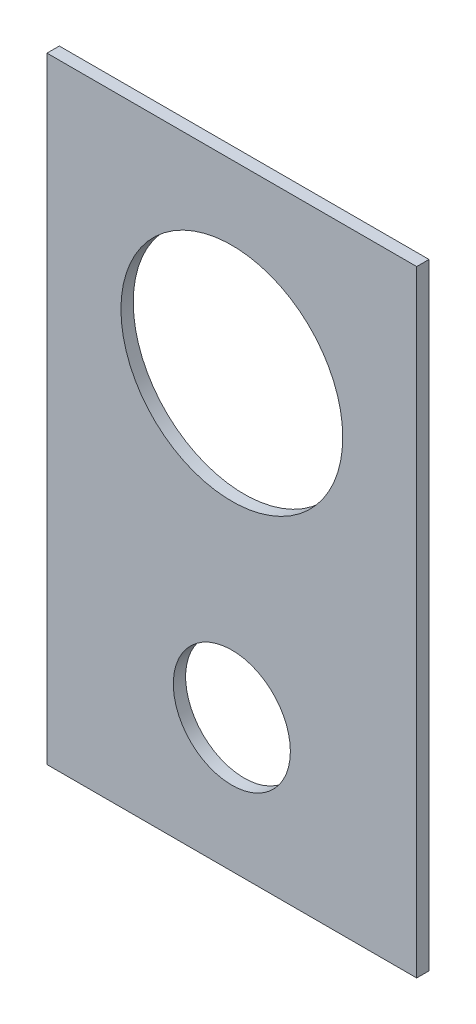
ISO-10303-21;
HEADER;
FILE_DESCRIPTION(('STEP AP214'),'2;1');
FILE_NAME('part.step','',(''),(''),'','','');
FILE_SCHEMA(('AUTOMOTIVE_DESIGN { 1 0 10303 214 1 1 1 1 }'));
ENDSEC;
DATA;
#1=APPLICATION_CONTEXT('core data for automotive mechanical design processes');
#2=APPLICATION_PROTOCOL_DEFINITION('international standard','automotive_design',2000,#1);
#3=PRODUCT_CONTEXT('',#1,'mechanical');
#4=PRODUCT('Part','Part','',(#3));
#5=PRODUCT_RELATED_PRODUCT_CATEGORY('part','',(#4));
#6=PRODUCT_DEFINITION_FORMATION('','',#4);
#7=PRODUCT_DEFINITION_CONTEXT('part definition',#1,'design');
#8=PRODUCT_DEFINITION('design','',#6,#7);
#9=PRODUCT_DEFINITION_SHAPE('','',#8);
#10=(LENGTH_UNIT() NAMED_UNIT(*) SI_UNIT(.MILLI.,.METRE.));
#11=(NAMED_UNIT(*) PLANE_ANGLE_UNIT() SI_UNIT($,.RADIAN.));
#12=(NAMED_UNIT(*) SI_UNIT($,.STERADIAN.) SOLID_ANGLE_UNIT());
#13=UNCERTAINTY_MEASURE_WITH_UNIT(LENGTH_MEASURE(1.E-05),#10,'distance_accuracy_value','');
#14=(GEOMETRIC_REPRESENTATION_CONTEXT(3) GLOBAL_UNCERTAINTY_ASSIGNED_CONTEXT((#13)) GLOBAL_UNIT_ASSIGNED_CONTEXT((#10,
#11,#12)) REPRESENTATION_CONTEXT('',''));
#15=CARTESIAN_POINT('',(0.,0.,0.));
#16=DIRECTION('',(0.,0.,1.));
#17=DIRECTION('',(1.,0.,0.));
#18=AXIS2_PLACEMENT_3D('',#15,#16,#17);
#19=CARTESIAN_POINT('',(0.,1100.09695005203,-9.99999999999975));
#20=DIRECTION('',(-1.,0.,0.));
#21=DIRECTION('',(0.,1.,0.));
#22=AXIS2_PLACEMENT_3D('',#19,#20,#21);
#23=PLANE('',#22);
#24=DIRECTION('',(0.,1.,0.));
#25=VECTOR('',#24,1.);
#26=CARTESIAN_POINT('',(0.,1100.09695005203,2.53676555219679E-13));
#27=LINE('',#26,#25);
#28=CARTESIAN_POINT('',(-1.20207153456121E-13,600.096950052034,0.));
#29=VERTEX_POINT('',#28);
#30=CARTESIAN_POINT('',(0.,1100.09695005203,2.53676555219679E-13));
#31=VERTEX_POINT('',#30);
#32=EDGE_CURVE('E94',#29,#31,#27,.T.);
#33=ORIENTED_EDGE('',*,*,#32,.T.);
#34=DIRECTION('',(0.,0.,1.));
#35=VECTOR('',#34,1.);
#36=CARTESIAN_POINT('',(0.,1100.09695005203,-9.99999999999975));
#37=LINE('',#36,#35);
#38=CARTESIAN_POINT('',(0.,1100.09695005203,-9.99999999999975));
#39=VERTEX_POINT('',#38);
#40=EDGE_CURVE('E33',#39,#31,#37,.T.);
#41=ORIENTED_EDGE('',*,*,#40,.F.);
#42=DIRECTION('',(0.,1.,0.));
#43=VECTOR('',#42,1.);
#44=CARTESIAN_POINT('',(0.,1100.09695005203,-9.99999999999975));
#45=LINE('',#44,#43);
#46=CARTESIAN_POINT('',(-1.20207153456121E-13,600.096950052034,-9.99999999999998));
#47=VERTEX_POINT('',#46);
#48=EDGE_CURVE('E83',#47,#39,#45,.T.);
#49=ORIENTED_EDGE('',*,*,#48,.F.);
#50=DIRECTION('',(0.,0.,1.));
#51=VECTOR('',#50,1.);
#52=CARTESIAN_POINT('',(-1.20207153456121E-13,600.096950052034,-9.99999999999998));
#53=LINE('',#52,#51);
#54=EDGE_CURVE('E11',#47,#29,#53,.T.);
#55=ORIENTED_EDGE('',*,*,#54,.T.);
#56=EDGE_LOOP('',(#33,#41,#49,#55));
#57=FACE_BOUND('',#56,.T.);
#58=ADVANCED_FACE('F30',(#57),#23,.T.);
#59=CARTESIAN_POINT('',(-1.20207153456121E-13,600.096950052034,-9.99999999999998));
#60=DIRECTION('',(0.,-1.,0.));
#61=DIRECTION('',(0.,0.,1.));
#62=AXIS2_PLACEMENT_3D('',#59,#60,#61);
#63=PLANE('',#62);
#64=DIRECTION('',(-1.,0.,0.));
#65=VECTOR('',#64,1.);
#66=CARTESIAN_POINT('',(-1.20207153456121E-13,600.096950052034,0.));
#67=LINE('',#66,#65);
#68=CARTESIAN_POINT('',(300.,600.096950052034,0.));
#69=VERTEX_POINT('',#68);
#70=EDGE_CURVE('E71',#69,#29,#67,.T.);
#71=ORIENTED_EDGE('',*,*,#70,.T.);
#72=ORIENTED_EDGE('',*,*,#54,.F.);
#73=DIRECTION('',(-1.,0.,0.));
#74=VECTOR('',#73,1.);
#75=CARTESIAN_POINT('',(-1.20207153456121E-13,600.096950052034,-9.99999999999998));
#76=LINE('',#75,#74);
#77=CARTESIAN_POINT('',(300.,600.096950052034,-9.99999999999998));
#78=VERTEX_POINT('',#77);
#79=EDGE_CURVE('E48',#78,#47,#76,.T.);
#80=ORIENTED_EDGE('',*,*,#79,.F.);
#81=DIRECTION('',(0.,0.,1.));
#82=VECTOR('',#81,1.);
#83=CARTESIAN_POINT('',(300.,600.096950052034,-9.99999999999998));
#84=LINE('',#83,#82);
#85=EDGE_CURVE('E39',#78,#69,#84,.T.);
#86=ORIENTED_EDGE('',*,*,#85,.T.);
#87=EDGE_LOOP('',(#71,#72,#80,#86));
#88=FACE_BOUND('',#87,.T.);
#89=ADVANCED_FACE('F101',(#88),#63,.T.);
#90=CARTESIAN_POINT('',(300.,1100.09695005203,-9.99999999999975));
#91=DIRECTION('',(1.,0.,0.));
#92=DIRECTION('',(0.,-1.,0.));
#93=AXIS2_PLACEMENT_3D('',#90,#91,#92);
#94=PLANE('',#93);
#95=DIRECTION('',(0.,-1.,0.));
#96=VECTOR('',#95,1.);
#97=CARTESIAN_POINT('',(300.,1100.09695005203,2.53676555219679E-13));
#98=LINE('',#97,#96);
#99=CARTESIAN_POINT('',(300.,1100.09695005203,2.53676555219679E-13));
#100=VERTEX_POINT('',#99);
#101=EDGE_CURVE('E65',#100,#69,#98,.T.);
#102=ORIENTED_EDGE('',*,*,#101,.T.);
#103=ORIENTED_EDGE('',*,*,#85,.F.);
#104=DIRECTION('',(0.,-1.,0.));
#105=VECTOR('',#104,1.);
#106=CARTESIAN_POINT('',(300.,1100.09695005203,-9.99999999999975));
#107=LINE('',#106,#105);
#108=CARTESIAN_POINT('',(300.,1100.09695005203,-9.99999999999975));
#109=VERTEX_POINT('',#108);
#110=EDGE_CURVE('E81',#109,#78,#107,.T.);
#111=ORIENTED_EDGE('',*,*,#110,.F.);
#112=DIRECTION('',(0.,0.,1.));
#113=VECTOR('',#112,1.);
#114=CARTESIAN_POINT('',(300.,1100.09695005203,-9.99999999999975));
#115=LINE('',#114,#113);
#116=EDGE_CURVE('E86',#109,#100,#115,.T.);
#117=ORIENTED_EDGE('',*,*,#116,.T.);
#118=EDGE_LOOP('',(#102,#103,#111,#117));
#119=FACE_BOUND('',#118,.T.);
#120=ADVANCED_FACE('F89',(#119),#94,.T.);
#121=CARTESIAN_POINT('',(0.,1100.09695005203,-9.99999999999975));
#122=DIRECTION('',(0.,1.,0.));
#123=DIRECTION('',(0.,0.,-1.));
#124=AXIS2_PLACEMENT_3D('',#121,#122,#123);
#125=PLANE('',#124);
#126=DIRECTION('',(1.,0.,0.));
#127=VECTOR('',#126,1.);
#128=CARTESIAN_POINT('',(0.,1100.09695005203,2.53676555219679E-13));
#129=LINE('',#128,#127);
#130=EDGE_CURVE('E88',#31,#100,#129,.T.);
#131=ORIENTED_EDGE('',*,*,#130,.T.);
#132=ORIENTED_EDGE('',*,*,#116,.F.);
#133=DIRECTION('',(1.,0.,0.));
#134=VECTOR('',#133,1.);
#135=CARTESIAN_POINT('',(0.,1100.09695005203,-9.99999999999975));
#136=LINE('',#135,#134);
#137=EDGE_CURVE('E78',#39,#109,#136,.T.);
#138=ORIENTED_EDGE('',*,*,#137,.F.);
#139=ORIENTED_EDGE('',*,*,#40,.T.);
#140=EDGE_LOOP('',(#131,#132,#138,#139));
#141=FACE_BOUND('',#140,.T.);
#142=ADVANCED_FACE('F87',(#141),#125,.T.);
#143=CARTESIAN_POINT('',(-1.20207153456121E-13,600.096950052034,-9.99999999999998));
#144=DIRECTION('',(0.,0.,-1.));
#145=DIRECTION('',(-1.,0.,0.));
#146=AXIS2_PLACEMENT_3D('',#143,#144,#145);
#147=PLANE('',#146);
#148=CARTESIAN_POINT('',(150.,708.096950052034,-9.99999999999993));
#149=DIRECTION('',(0.,0.,-1.));
#150=DIRECTION('',(1.,0.,0.));
#151=AXIS2_PLACEMENT_3D('',#148,#149,#150);
#152=CIRCLE('',#151,47.5);
#153=CARTESIAN_POINT('',(197.5,708.096950052034,-9.99999999999993));
#154=VERTEX_POINT('',#153);
#155=EDGE_CURVE('E110',#154,#154,#152,.T.);
#156=ORIENTED_EDGE('',*,*,#155,.F.);
#157=EDGE_LOOP('',(#156));
#158=FACE_BOUND('',#157,.T.);
#159=CARTESIAN_POINT('',(150.,950.096950052034,-9.99999999999982));
#160=DIRECTION('',(0.,0.,-1.));
#161=DIRECTION('',(1.,0.,0.));
#162=AXIS2_PLACEMENT_3D('',#159,#160,#161);
#163=CIRCLE('',#162,90.);
#164=CARTESIAN_POINT('',(240.,950.096950052034,-9.99999999999982));
#165=VERTEX_POINT('',#164);
#166=EDGE_CURVE('E97',#165,#165,#163,.T.);
#167=ORIENTED_EDGE('',*,*,#166,.F.);
#168=EDGE_LOOP('',(#167));
#169=FACE_BOUND('',#168,.T.);
#170=ORIENTED_EDGE('',*,*,#48,.T.);
#171=ORIENTED_EDGE('',*,*,#137,.T.);
#172=ORIENTED_EDGE('',*,*,#110,.T.);
#173=ORIENTED_EDGE('',*,*,#79,.T.);
#174=EDGE_LOOP('',(#170,#171,#172,#173));
#175=FACE_BOUND('',#174,.T.);
#176=ADVANCED_FACE('F79',(#158,#169,#175),#147,.T.);
#177=CARTESIAN_POINT('',(-1.20207153456121E-13,600.096950052034,0.));
#178=DIRECTION('',(0.,0.,-1.));
#179=DIRECTION('',(-1.,0.,0.));
#180=AXIS2_PLACEMENT_3D('',#177,#178,#179);
#181=PLANE('',#180);
#182=CARTESIAN_POINT('',(150.,708.096950052034,0.));
#183=DIRECTION('',(0.,0.,-1.));
#184=DIRECTION('',(1.,0.,0.));
#185=AXIS2_PLACEMENT_3D('',#182,#183,#184);
#186=CIRCLE('',#185,47.5);
#187=CARTESIAN_POINT('',(197.5,708.096950052034,0.));
#188=VERTEX_POINT('',#187);
#189=EDGE_CURVE('E113',#188,#188,#186,.T.);
#190=ORIENTED_EDGE('',*,*,#189,.T.);
#191=EDGE_LOOP('',(#190));
#192=FACE_BOUND('',#191,.T.);
#193=CARTESIAN_POINT('',(150.,950.096950052034,1.84498137297237E-13));
#194=DIRECTION('',(0.,0.,-1.));
#195=DIRECTION('',(1.,0.,0.));
#196=AXIS2_PLACEMENT_3D('',#193,#194,#195);
#197=CIRCLE('',#196,90.);
#198=CARTESIAN_POINT('',(240.,950.096950052034,1.84498137297237E-13));
#199=VERTEX_POINT('',#198);
#200=EDGE_CURVE('E107',#199,#199,#197,.T.);
#201=ORIENTED_EDGE('',*,*,#200,.T.);
#202=EDGE_LOOP('',(#201));
#203=FACE_BOUND('',#202,.T.);
#204=ORIENTED_EDGE('',*,*,#32,.F.);
#205=ORIENTED_EDGE('',*,*,#70,.F.);
#206=ORIENTED_EDGE('',*,*,#101,.F.);
#207=ORIENTED_EDGE('',*,*,#130,.F.);
#208=EDGE_LOOP('',(#204,#205,#206,#207));
#209=FACE_BOUND('',#208,.T.);
#210=ADVANCED_FACE('F104',(#192,#203,#209),#181,.F.);
#211=CARTESIAN_POINT('',(150.,950.096950052034,-9.99999999999982));
#212=DIRECTION('',(0.,0.,1.));
#213=DIRECTION('',(1.,0.,0.));
#214=AXIS2_PLACEMENT_3D('',#211,#212,#213);
#215=CYLINDRICAL_SURFACE('',#214,90.);
#216=ORIENTED_EDGE('',*,*,#166,.T.);
#217=EDGE_LOOP('',(#216));
#218=FACE_BOUND('',#217,.T.);
#219=ORIENTED_EDGE('',*,*,#200,.F.);
#220=EDGE_LOOP('',(#219));
#221=FACE_BOUND('',#220,.T.);
#222=ADVANCED_FACE('F127',(#218,#221),#215,.F.);
#223=CARTESIAN_POINT('',(150.,708.096950052034,-9.99999999999993));
#224=DIRECTION('',(0.,0.,1.));
#225=DIRECTION('',(1.,0.,0.));
#226=AXIS2_PLACEMENT_3D('',#223,#224,#225);
#227=CYLINDRICAL_SURFACE('',#226,47.5);
#228=ORIENTED_EDGE('',*,*,#155,.T.);
#229=EDGE_LOOP('',(#228));
#230=FACE_BOUND('',#229,.T.);
#231=ORIENTED_EDGE('',*,*,#189,.F.);
#232=EDGE_LOOP('',(#231));
#233=FACE_BOUND('',#232,.T.);
#234=ADVANCED_FACE('F119',(#230,#233),#227,.F.);
#235=CLOSED_SHELL('',(#58,#89,#120,#142,#176,#210,#222,#234));
#236=MANIFOLD_SOLID_BREP('B2',#235);
#237=ADVANCED_BREP_SHAPE_REPRESENTATION('',(#18,#236),#14);
#238=SHAPE_DEFINITION_REPRESENTATION(#9,#237);
ENDSEC;
END-ISO-10303-21;
